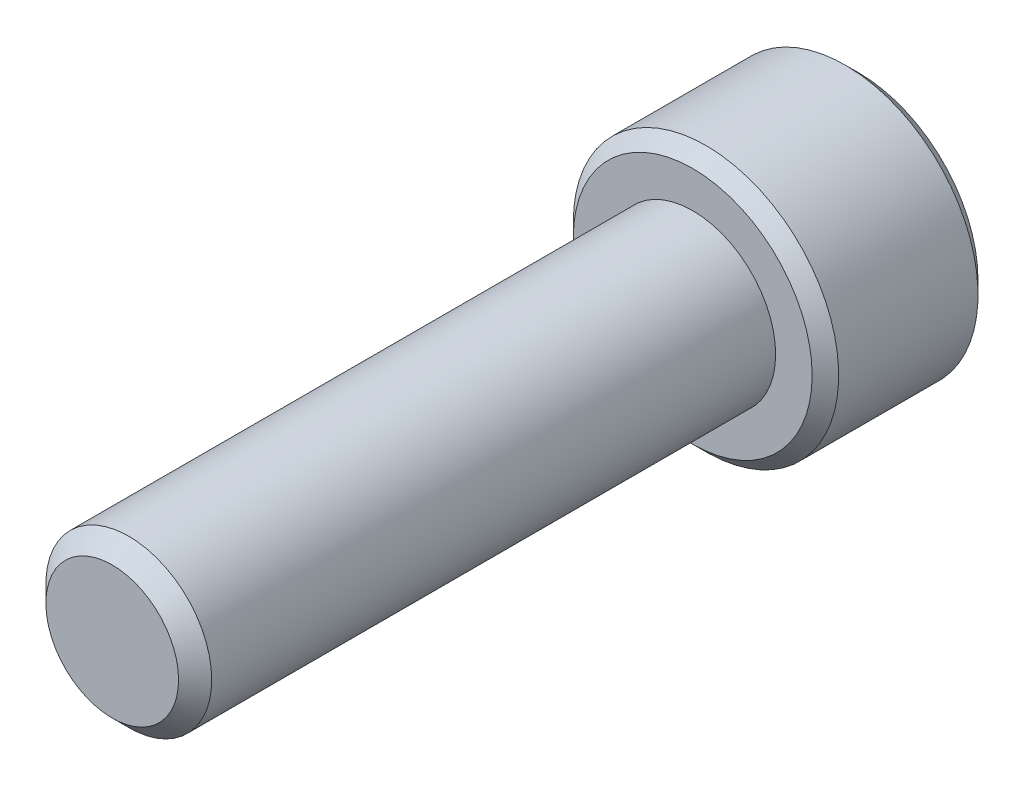
ISO-10303-21;
HEADER;
FILE_DESCRIPTION(('STEP AP214'),'2;1');
FILE_NAME('part.step','',(''),(''),'','','');
FILE_SCHEMA(('AUTOMOTIVE_DESIGN { 1 0 10303 214 1 1 1 1 }'));
ENDSEC;
DATA;
#1=APPLICATION_CONTEXT('core data for automotive mechanical design processes');
#2=APPLICATION_PROTOCOL_DEFINITION('international standard','automotive_design',2000,#1);
#3=PRODUCT_CONTEXT('',#1,'mechanical');
#4=PRODUCT('Part','Part','',(#3));
#5=PRODUCT_RELATED_PRODUCT_CATEGORY('part','',(#4));
#6=PRODUCT_DEFINITION_FORMATION('','',#4);
#7=PRODUCT_DEFINITION_CONTEXT('part definition',#1,'design');
#8=PRODUCT_DEFINITION('design','',#6,#7);
#9=PRODUCT_DEFINITION_SHAPE('','',#8);
#10=(LENGTH_UNIT() NAMED_UNIT(*) SI_UNIT(.MILLI.,.METRE.));
#11=(NAMED_UNIT(*) PLANE_ANGLE_UNIT() SI_UNIT($,.RADIAN.));
#12=(NAMED_UNIT(*) SI_UNIT($,.STERADIAN.) SOLID_ANGLE_UNIT());
#13=UNCERTAINTY_MEASURE_WITH_UNIT(LENGTH_MEASURE(1.E-05),#10,'distance_accuracy_value','');
#14=(GEOMETRIC_REPRESENTATION_CONTEXT(3) GLOBAL_UNCERTAINTY_ASSIGNED_CONTEXT((#13)) GLOBAL_UNIT_ASSIGNED_CONTEXT((#10,
#11,#12)) REPRESENTATION_CONTEXT('',''));
#15=CARTESIAN_POINT('',(0.,0.,0.));
#16=DIRECTION('',(0.,0.,1.));
#17=DIRECTION('',(1.,0.,0.));
#18=AXIS2_PLACEMENT_3D('',#15,#16,#17);
#19=CARTESIAN_POINT('',(0.,0.,-35.));
#20=DIRECTION('',(0.,0.,1.));
#21=DIRECTION('',(1.,0.,0.));
#22=AXIS2_PLACEMENT_3D('',#19,#20,#21);
#23=CYLINDRICAL_SURFACE('',#22,5.);
#24=CARTESIAN_POINT('',(0.,0.,-1.00000000000001));
#25=DIRECTION('',(0.,0.,1.));
#26=DIRECTION('',(1.,0.,0.));
#27=AXIS2_PLACEMENT_3D('',#24,#25,#26);
#28=CIRCLE('',#27,5.);
#29=CARTESIAN_POINT('',(5.,0.,-1.00000000000001));
#30=VERTEX_POINT('',#29);
#31=EDGE_CURVE('E13',#30,#30,#28,.F.);
#32=ORIENTED_EDGE('',*,*,#31,.T.);
#33=EDGE_LOOP('',(#32));
#34=FACE_BOUND('',#33,.T.);
#35=CARTESIAN_POINT('',(0.,0.,-35.));
#36=DIRECTION('',(0.,0.,-1.));
#37=DIRECTION('',(-1.,0.,0.));
#38=AXIS2_PLACEMENT_3D('',#35,#36,#37);
#39=CIRCLE('',#38,5.);
#40=CARTESIAN_POINT('',(-5.,0.,-35.));
#41=VERTEX_POINT('',#40);
#42=EDGE_CURVE('E121',#41,#41,#39,.F.);
#43=ORIENTED_EDGE('',*,*,#42,.T.);
#44=EDGE_LOOP('',(#43));
#45=FACE_BOUND('',#44,.T.);
#46=ADVANCED_FACE('F47',(#34,#45),#23,.T.);
#47=CARTESIAN_POINT('',(0.,0.,0.));
#48=DIRECTION('',(0.,0.,1.));
#49=DIRECTION('',(1.,0.,0.));
#50=AXIS2_PLACEMENT_3D('',#47,#48,#49);
#51=PLANE('',#50);
#52=CARTESIAN_POINT('',(0.,0.,0.));
#53=DIRECTION('',(0.,0.,1.));
#54=DIRECTION('',(1.,0.,0.));
#55=AXIS2_PLACEMENT_3D('',#52,#53,#54);
#56=CIRCLE('',#55,4.);
#57=CARTESIAN_POINT('',(4.,0.,0.));
#58=VERTEX_POINT('',#57);
#59=EDGE_CURVE('E55',#58,#58,#56,.T.);
#60=ORIENTED_EDGE('',*,*,#59,.T.);
#61=EDGE_LOOP('',(#60));
#62=FACE_BOUND('',#61,.T.);
#63=ADVANCED_FACE('F191',(#62),#51,.T.);
#64=CARTESIAN_POINT('',(0.,0.,-45.));
#65=DIRECTION('',(0.,0.,1.));
#66=DIRECTION('',(1.,0.,0.));
#67=AXIS2_PLACEMENT_3D('',#64,#65,#66);
#68=CYLINDRICAL_SURFACE('',#67,8.);
#69=CARTESIAN_POINT('',(0.,0.,-44.2));
#70=DIRECTION('',(0.,0.,-1.));
#71=DIRECTION('',(-1.,0.,0.));
#72=AXIS2_PLACEMENT_3D('',#69,#70,#71);
#73=CIRCLE('',#72,8.);
#74=CARTESIAN_POINT('',(-8.,0.,-44.2));
#75=VERTEX_POINT('',#74);
#76=EDGE_CURVE('E183',#75,#75,#73,.F.);
#77=ORIENTED_EDGE('',*,*,#76,.T.);
#78=EDGE_LOOP('',(#77));
#79=FACE_BOUND('',#78,.T.);
#80=CARTESIAN_POINT('',(0.,0.,-35.8));
#81=DIRECTION('',(0.,0.,-1.));
#82=DIRECTION('',(-1.,0.,0.));
#83=AXIS2_PLACEMENT_3D('',#80,#81,#82);
#84=CIRCLE('',#83,8.);
#85=CARTESIAN_POINT('',(-8.,0.,-35.8));
#86=VERTEX_POINT('',#85);
#87=EDGE_CURVE('E180',#86,#86,#84,.T.);
#88=ORIENTED_EDGE('',*,*,#87,.T.);
#89=EDGE_LOOP('',(#88));
#90=FACE_BOUND('',#89,.T.);
#91=ADVANCED_FACE('F208',(#79,#90),#68,.T.);
#92=CARTESIAN_POINT('',(0.,0.,-45.));
#93=DIRECTION('',(0.,0.,-1.));
#94=DIRECTION('',(-1.,0.,0.));
#95=AXIS2_PLACEMENT_3D('',#92,#93,#94);
#96=PLANE('',#95);
#97=CARTESIAN_POINT('',(0.,0.,-45.));
#98=DIRECTION('',(0.,0.,-1.));
#99=DIRECTION('',(-1.,0.,0.));
#100=AXIS2_PLACEMENT_3D('',#97,#98,#99);
#101=CIRCLE('',#100,7.19999999999999);
#102=CARTESIAN_POINT('',(-7.19999999999999,0.,-45.));
#103=VERTEX_POINT('',#102);
#104=EDGE_CURVE('E120',#103,#103,#101,.T.);
#105=ORIENTED_EDGE('',*,*,#104,.T.);
#106=EDGE_LOOP('',(#105));
#107=FACE_BOUND('',#106,.T.);
#108=CARTESIAN_POINT('',(0.,0.,-45.));
#109=DIRECTION('',(0.,0.,-1.));
#110=DIRECTION('',(-1.,0.,0.));
#111=AXIS2_PLACEMENT_3D('',#108,#109,#110);
#112=CIRCLE('',#111,4.618802153517);
#113=CARTESIAN_POINT('',(-4.,2.3094010767585,-45.));
#114=VERTEX_POINT('',#113);
#115=CARTESIAN_POINT('',(0.,4.61880215351701,-45.));
#116=VERTEX_POINT('',#115);
#117=EDGE_CURVE('E101',#114,#116,#112,.T.);
#118=ORIENTED_EDGE('',*,*,#117,.F.);
#119=CARTESIAN_POINT('',(-4.,-2.3094010767585,-45.));
#120=VERTEX_POINT('',#119);
#121=EDGE_CURVE('E61',#120,#114,#112,.T.);
#122=ORIENTED_EDGE('',*,*,#121,.F.);
#123=CARTESIAN_POINT('',(0.,-4.61880215351701,-45.));
#124=VERTEX_POINT('',#123);
#125=EDGE_CURVE('E415',#124,#120,#112,.T.);
#126=ORIENTED_EDGE('',*,*,#125,.F.);
#127=CARTESIAN_POINT('',(4.,-2.3094010767585,-45.));
#128=VERTEX_POINT('',#127);
#129=EDGE_CURVE('E68',#128,#124,#112,.T.);
#130=ORIENTED_EDGE('',*,*,#129,.F.);
#131=CARTESIAN_POINT('',(4.,2.3094010767585,-45.));
#132=VERTEX_POINT('',#131);
#133=EDGE_CURVE('E142',#132,#128,#112,.T.);
#134=ORIENTED_EDGE('',*,*,#133,.F.);
#135=EDGE_CURVE('E110',#116,#132,#112,.T.);
#136=ORIENTED_EDGE('',*,*,#135,.F.);
#137=EDGE_LOOP('',(#118,#122,#126,#130,#134,#136));
#138=FACE_BOUND('',#137,.T.);
#139=ADVANCED_FACE('F141',(#107,#138),#96,.T.);
#140=CARTESIAN_POINT('',(0.,0.,-35.));
#141=DIRECTION('',(0.,0.,-1.));
#142=DIRECTION('',(-1.,0.,0.));
#143=AXIS2_PLACEMENT_3D('',#140,#141,#142);
#144=PLANE('',#143);
#145=CARTESIAN_POINT('',(0.,0.,-35.));
#146=DIRECTION('',(0.,0.,-1.));
#147=DIRECTION('',(-1.,0.,0.));
#148=AXIS2_PLACEMENT_3D('',#145,#146,#147);
#149=CIRCLE('',#148,7.19999999999999);
#150=CARTESIAN_POINT('',(-7.19999999999999,0.,-35.));
#151=VERTEX_POINT('',#150);
#152=EDGE_CURVE('E186',#151,#151,#149,.F.);
#153=ORIENTED_EDGE('',*,*,#152,.T.);
#154=EDGE_LOOP('',(#153));
#155=FACE_BOUND('',#154,.T.);
#156=ORIENTED_EDGE('',*,*,#42,.F.);
#157=EDGE_LOOP('',(#156));
#158=FACE_BOUND('',#157,.T.);
#159=ADVANCED_FACE('F224',(#155,#158),#144,.F.);
#160=CARTESIAN_POINT('',(0.,0.,-45.));
#161=DIRECTION('',(0.,0.,-1.));
#162=DIRECTION('',(-1.,0.,0.));
#163=AXIS2_PLACEMENT_3D('',#160,#161,#162);
#164=CONICAL_SURFACE('',#163,4.618802153517,0.78539816339745);
#165=ORIENTED_EDGE('',*,*,#135,.T.);
#166=CARTESIAN_POINT('',(-0.000199999999997142,4.61891762357084,-45.0001154743839));
#167=CARTESIAN_POINT('',(0.068580984718387,4.57920690352856,-44.9604088559576));
#168=CARTESIAN_POINT('',(0.137888304896505,4.53919230356691,-44.9219204171132));
#169=CARTESIAN_POINT('',(0.277664036763597,4.45849274714726,-44.8477512237355));
#170=CARTESIAN_POINT('',(0.348133057578707,4.41780743901013,-44.8120720027316));
#171=CARTESIAN_POINT('',(0.562100081603904,4.29427352009148,-44.709500867651));
#172=CARTESIAN_POINT('',(0.707416589267747,4.21037499527406,-44.6475131110126));
#173=CARTESIAN_POINT('',(1.00040214981326,4.04121970302444,-44.5413558690094));
#174=CARTESIAN_POINT('',(1.14799719663765,3.95600566300932,-44.4969190554534));
#175=CARTESIAN_POINT('',(1.44644641508887,3.78369592639708,-44.4284489821295));
#176=CARTESIAN_POINT('',(1.59729144640344,3.69660550696169,-44.4043646378613));
#177=CARTESIAN_POINT('',(1.85726690511356,3.54650860589271,-44.3826348808605));
#178=CARTESIAN_POINT('',(1.96606238220553,3.48369550790705,-44.3794189146409));
#179=CARTESIAN_POINT('',(2.18347675426333,3.35817126167378,-44.384840058225));
#180=CARTESIAN_POINT('',(2.29209557396636,3.29546015687918,-44.3934813231718));
#181=CARTESIAN_POINT('',(2.50830402737816,3.1706321481008,-44.4221240384964));
#182=CARTESIAN_POINT('',(2.61589237292034,3.10851598784036,-44.4421381945513));
#183=CARTESIAN_POINT('',(2.82922129322135,2.98535047827864,-44.4924341573647));
#184=CARTESIAN_POINT('',(2.93496200899965,2.92430104755974,-44.5227151768784));
#185=CARTESIAN_POINT('',(3.12267722089176,2.81592361944283,-44.5850152526942));
#186=CARTESIAN_POINT('',(3.20506731843131,2.76835567444982,-44.6153962798601));
#187=CARTESIAN_POINT('',(3.3683684620413,2.67407371522762,-44.6810544645603));
#188=CARTESIAN_POINT('',(3.44927946303276,2.62735972702479,-44.7163317710398));
#189=CARTESIAN_POINT('',(3.60936749601013,2.53493285809127,-44.7909916870209));
#190=CARTESIAN_POINT('',(3.68854908118624,2.48921734857498,-44.8303613870036));
#191=CARTESIAN_POINT('',(3.84544590098816,2.39863292742735,-44.9126891081433));
#192=CARTESIAN_POINT('',(3.92316199986077,2.35376351682288,-44.955644927802));
#193=CARTESIAN_POINT('',(4.0002,2.30928560670466,-45.0001154743839));
#194=B_SPLINE_CURVE_WITH_KNOTS('',3,(#166,#167,#168,#169,#170,#171,#172,#173,#174,#175,#176,
#177,#178,#179,#180,#181,#182,#183,#184,#185,#186,#187,#188,#189,#190,#191,#192,#193),
.UNSPECIFIED.,.F.,.F.,(4,2,2,2,2,2,2,2,2,2,2,2,2,4),(0.,0.266361961703664,0.53286833440011,
1.06875865685462,1.5961388459405,2.1221913505558,2.49866160599657,2.87526382203494,
3.25228760372076,3.62928248242857,3.92874944437161,4.22822551811344,4.52678401907573,
4.82516056577921),.UNSPECIFIED.);
#195=EDGE_CURVE('E115',#116,#132,#194,.T.);
#196=ORIENTED_EDGE('',*,*,#195,.F.);
#197=EDGE_LOOP('',(#165,#196));
#198=FACE_BOUND('',#197,.T.);
#199=ADVANCED_FACE('F116',(#198),#164,.F.);
#200=ORIENTED_EDGE('',*,*,#133,.T.);
#201=CARTESIAN_POINT('',(4.,-4.60588834585846,-46.4815427100554));
#202=CARTESIAN_POINT('',(4.,-4.49374002821923,-46.3968876312289));
#203=CARTESIAN_POINT('',(4.,-4.3809637982101,-46.3130508557852));
#204=CARTESIAN_POINT('',(4.,-4.1539078224607,-46.1473802935295));
#205=CARTESIAN_POINT('',(4.,-4.03962770639666,-46.0655470148149));
#206=CARTESIAN_POINT('',(4.,-3.80848031083369,-45.9036679969616));
#207=CARTESIAN_POINT('',(4.,-3.69159984616662,-45.8236410211269));
#208=CARTESIAN_POINT('',(4.,-3.45585499794048,-45.6665741495931));
#209=CARTESIAN_POINT('',(4.,-3.33699075539682,-45.5895340428573));
#210=CARTESIAN_POINT('',(4.,-3.09010281107529,-45.4348060364959));
#211=CARTESIAN_POINT('',(4.,-2.96194389824947,-45.3573327874458));
#212=CARTESIAN_POINT('',(4.,-2.7026345868228,-45.207483494942));
#213=CARTESIAN_POINT('',(4.,-2.57148371860611,-45.1351082590594));
#214=CARTESIAN_POINT('',(4.,-2.3062026958856,-44.9970165999514));
#215=CARTESIAN_POINT('',(4.,-2.17208281432629,-44.931280596426));
#216=CARTESIAN_POINT('',(4.,-1.90018524463694,-44.8079389856064));
#217=CARTESIAN_POINT('',(4.,-1.76240924651061,-44.750329696999));
#218=CARTESIAN_POINT('',(4.,-1.49423245423071,-44.6495195910183));
#219=CARTESIAN_POINT('',(4.,-1.36413038006123,-44.6055323527125));
#220=CARTESIAN_POINT('',(4.,-1.10079389466481,-44.5279953825842));
#221=CARTESIAN_POINT('',(4.,-0.96755926832832,-44.49444636981));
#222=CARTESIAN_POINT('',(4.,-0.70096926371332,-44.4400959937613));
#223=CARTESIAN_POINT('',(4.,-0.567659151489365,-44.4190762199428));
#224=CARTESIAN_POINT('',(4.,-0.299613801548666,-44.3901923046075));
#225=CARTESIAN_POINT('',(4.,-0.164878812816917,-44.3823259016629));
#226=CARTESIAN_POINT('',(4.,0.0998110426161455,-44.3803329421123));
#227=CARTESIAN_POINT('',(4.,0.229762408781348,-44.3857193675581));
#228=CARTESIAN_POINT('',(4.,0.488552004486205,-44.4088600629805));
#229=CARTESIAN_POINT('',(4.,0.617390124658867,-44.4266155344344));
#230=CARTESIAN_POINT('',(4.,0.875199003234474,-44.4738276474748));
#231=CARTESIAN_POINT('',(4.,1.00413270849071,-44.5034834133105));
#232=CARTESIAN_POINT('',(4.,1.25919079381533,-44.5729145209428));
#233=CARTESIAN_POINT('',(4.,1.38531540799082,-44.6126890159958));
#234=CARTESIAN_POINT('',(4.,1.64617719318931,-44.7048119901029));
#235=CARTESIAN_POINT('',(4.,1.78061927932313,-44.7579876430135));
#236=CARTESIAN_POINT('',(4.,2.046011294482,-44.8725026332475));
#237=CARTESIAN_POINT('',(4.,2.17695956238624,-44.9338457735747));
#238=CARTESIAN_POINT('',(4.,2.4360038929671,-45.0632362545334));
#239=CARTESIAN_POINT('',(4.,2.5640893557596,-45.1313046457109));
#240=CARTESIAN_POINT('',(4.,2.81731270115426,-45.2726411351195));
#241=CARTESIAN_POINT('',(4.,2.94245104834804,-45.345908406377));
#242=CARTESIAN_POINT('',(4.,3.18400809183147,-45.4928694369693));
#243=CARTESIAN_POINT('',(4.,3.3005507821615,-45.5663604651561));
#244=CARTESIAN_POINT('',(4.,3.53163540616219,-45.7164329441833));
#245=CARTESIAN_POINT('',(4.,3.64617718734196,-45.7930146291055));
#246=CARTESIAN_POINT('',(4.,3.87259303922057,-45.9480834223493));
#247=CARTESIAN_POINT('',(4.,3.98448122200406,-46.0265499994366));
#248=CARTESIAN_POINT('',(4.,4.20672850859698,-46.1855582141516));
#249=CARTESIAN_POINT('',(4.,4.31708802443964,-46.2660992752063));
#250=CARTESIAN_POINT('',(4.,4.42680741385316,-46.3474884762919));
#251=B_SPLINE_CURVE_WITH_KNOTS('',3,(#201,#202,#203,#204,#205,#206,#207,#208,#209,#210,#211,
#212,#213,#214,#215,#216,#217,#218,#219,#220,#221,#222,#223,#224,#225,#226,#227,#228,#229,#230,
#231,#232,#233,#234,#235,#236,#237,#238,#239,#240,#241,#242,#243,#244,#245,#246,#247,#248,#249,
#250),.UNSPECIFIED.,.F.,.F.,(4,2,2,2,2,2,2,2,2,2,2,2,2,2,2,2,2,2,2,2,2,2,2,2,4),(0.,
0.421545463953783,0.843196749317179,1.26811510924698,1.69300339174034,2.14217661823513,
2.59142083852277,3.03929889601296,3.48697341360786,3.8986221993791,4.31029933574146,
4.71457260722766,5.11877636581775,5.50834966824607,5.89796081747125,6.29438282622666,
6.69077167296899,7.12416312979248,7.55775709580142,7.99275404267761,8.42768195006618,
8.8409624853466,9.25427438085209,9.66422889385946,10.0740706699154),.UNSPECIFIED.);
#252=EDGE_CURVE('E109',#132,#128,#251,.F.);
#253=ORIENTED_EDGE('',*,*,#252,.F.);
#254=EDGE_LOOP('',(#200,#253));
#255=FACE_BOUND('',#254,.T.);
#256=ADVANCED_FACE('F291',(#255),#164,.F.);
#257=ORIENTED_EDGE('',*,*,#129,.T.);
#258=CARTESIAN_POINT('',(4.0002,-2.30928560670467,-45.0001154743839));
#259=CARTESIAN_POINT('',(3.93141901528162,-2.34899632674695,-44.9604088559576));
#260=CARTESIAN_POINT('',(3.8621116951035,-2.3890109267086,-44.9219204171132));
#261=CARTESIAN_POINT('',(3.72233596323641,-2.46971048312824,-44.8477512237355));
#262=CARTESIAN_POINT('',(3.6518669424213,-2.51039579126538,-44.8120720027316));
#263=CARTESIAN_POINT('',(3.4378999183961,-2.63392971018403,-44.709500867651));
#264=CARTESIAN_POINT('',(3.29258341073226,-2.71782823500144,-44.6475131110126));
#265=CARTESIAN_POINT('',(2.99959785018675,-2.88698352725107,-44.5413558690094));
#266=CARTESIAN_POINT('',(2.85200280336236,-2.97219756726618,-44.4969190554534));
#267=CARTESIAN_POINT('',(2.55355358491113,-3.14450730387843,-44.4284489821295));
#268=CARTESIAN_POINT('',(2.40270855359656,-3.23159772331381,-44.4043646378613));
#269=CARTESIAN_POINT('',(2.14273309488644,-3.3816946243828,-44.3826348808605));
#270=CARTESIAN_POINT('',(2.03393761779447,-3.44450772236846,-44.3794189146409));
#271=CARTESIAN_POINT('',(1.81652324573667,-3.57003196860173,-44.384840058225));
#272=CARTESIAN_POINT('',(1.70790442603364,-3.63274307339633,-44.3934813231718));
#273=CARTESIAN_POINT('',(1.49169597262184,-3.75757108217471,-44.4221240384964));
#274=CARTESIAN_POINT('',(1.38410762707967,-3.81968724243515,-44.4421381945513));
#275=CARTESIAN_POINT('',(1.17077870677865,-3.94285275199687,-44.4924341573647));
#276=CARTESIAN_POINT('',(1.06503799100036,-4.00390218271577,-44.5227151768784));
#277=CARTESIAN_POINT('',(0.877322779108237,-4.11227961083268,-44.5850152526942));
#278=CARTESIAN_POINT('',(0.794932681568687,-4.15984755582569,-44.6153962798601));
#279=CARTESIAN_POINT('',(0.631631537958704,-4.25412951504789,-44.6810544645603));
#280=CARTESIAN_POINT('',(0.550720536967238,-4.30084350325072,-44.7163317710398));
#281=CARTESIAN_POINT('',(0.390632503989868,-4.39327037218424,-44.7909916870209));
#282=CARTESIAN_POINT('',(0.311450918813762,-4.43898588170052,-44.8303613870036));
#283=CARTESIAN_POINT('',(0.154554099011843,-4.52957030284816,-44.9126891081433));
#284=CARTESIAN_POINT('',(0.0768380001392331,-4.57443971345263,-44.955644927802));
#285=CARTESIAN_POINT('',(-0.000200000000001147,-4.61891762357084,-45.0001154743839));
#286=B_SPLINE_CURVE_WITH_KNOTS('',3,(#258,#259,#260,#261,#262,#263,#264,#265,#266,#267,#268,
#269,#270,#271,#272,#273,#274,#275,#276,#277,#278,#279,#280,#281,#282,#283,#284,#285),
.UNSPECIFIED.,.F.,.F.,(4,2,2,2,2,2,2,2,2,2,2,2,2,4),(0.,0.266361961703661,0.53286833440011,
1.06875865685462,1.59613884594051,2.1221913505558,2.49866160599658,2.87526382203494,
3.25228760372076,3.62928248242858,3.92874944437161,4.22822551811345,4.52678401907573,
4.82516056577922),.UNSPECIFIED.);
#287=EDGE_CURVE('E151',#128,#124,#286,.T.);
#288=ORIENTED_EDGE('',*,*,#287,.F.);
#289=EDGE_LOOP('',(#257,#288));
#290=FACE_BOUND('',#289,.T.);
#291=ADVANCED_FACE('F283',(#290),#164,.F.);
#292=ORIENTED_EDGE('',*,*,#125,.T.);
#293=CARTESIAN_POINT('',(0.000200000000000023,-4.61891762357084,-45.0001154743839));
#294=CARTESIAN_POINT('',(-0.0685809847183827,-4.57920690352856,-44.9604088559576));
#295=CARTESIAN_POINT('',(-0.1378883048965,-4.53919230356691,-44.9219204171132));
#296=CARTESIAN_POINT('',(-0.277664036763593,-4.45849274714727,-44.8477512237355));
#297=CARTESIAN_POINT('',(-0.348133057578705,-4.41780743901013,-44.8120720027316));
#298=CARTESIAN_POINT('',(-0.562100081603903,-4.29427352009148,-44.709500867651));
#299=CARTESIAN_POINT('',(-0.707416589267745,-4.21037499527407,-44.6475131110126));
#300=CARTESIAN_POINT('',(-1.00040214981325,-4.04121970302444,-44.5413558690094));
#301=CARTESIAN_POINT('',(-1.14799719663764,-3.95600566300933,-44.4969190554534));
#302=CARTESIAN_POINT('',(-1.44644641508887,-3.78369592639708,-44.4284489821295));
#303=CARTESIAN_POINT('',(-1.59729144640344,-3.6966055069617,-44.4043646378613));
#304=CARTESIAN_POINT('',(-1.85726690511356,-3.54650860589271,-44.3826348808605));
#305=CARTESIAN_POINT('',(-1.96606238220553,-3.48369550790705,-44.3794189146409));
#306=CARTESIAN_POINT('',(-2.18347675426333,-3.35817126167378,-44.384840058225));
#307=CARTESIAN_POINT('',(-2.29209557396636,-3.29546015687918,-44.3934813231718));
#308=CARTESIAN_POINT('',(-2.50830402737816,-3.17063214810081,-44.4221240384964));
#309=CARTESIAN_POINT('',(-2.61589237292033,-3.10851598784036,-44.4421381945513));
#310=CARTESIAN_POINT('',(-2.82922129322134,-2.98535047827864,-44.4924341573647));
#311=CARTESIAN_POINT('',(-2.93496200899964,-2.92430104755974,-44.5227151768784));
#312=CARTESIAN_POINT('',(-3.12267722089176,-2.81592361944283,-44.5850152526942));
#313=CARTESIAN_POINT('',(-3.20506731843131,-2.76835567444982,-44.6153962798601));
#314=CARTESIAN_POINT('',(-3.3683684620413,-2.67407371522762,-44.6810544645603));
#315=CARTESIAN_POINT('',(-3.44927946303277,-2.62735972702479,-44.7163317710398));
#316=CARTESIAN_POINT('',(-3.60936749601014,-2.53493285809127,-44.7909916870209));
#317=CARTESIAN_POINT('',(-3.68854908118624,-2.48921734857498,-44.8303613870036));
#318=CARTESIAN_POINT('',(-3.84544590098816,-2.39863292742735,-44.9126891081433));
#319=CARTESIAN_POINT('',(-3.92316199986077,-2.35376351682288,-44.955644927802));
#320=CARTESIAN_POINT('',(-4.0002,-2.30928560670467,-45.0001154743839));
#321=B_SPLINE_CURVE_WITH_KNOTS('',3,(#293,#294,#295,#296,#297,#298,#299,#300,#301,#302,#303,
#304,#305,#306,#307,#308,#309,#310,#311,#312,#313,#314,#315,#316,#317,#318,#319,#320),
.UNSPECIFIED.,.F.,.F.,(4,2,2,2,2,2,2,2,2,2,2,2,2,4),(0.,0.266361961703662,0.532868334400111,
1.06875865685462,1.5961388459405,2.1221913505558,2.49866160599658,2.87526382203494,
3.25228760372076,3.62928248242857,3.92874944437161,4.22822551811345,4.52678401907574,
4.82516056577922),.UNSPECIFIED.);
#322=EDGE_CURVE('E378',#124,#120,#321,.T.);
#323=ORIENTED_EDGE('',*,*,#322,.F.);
#324=EDGE_LOOP('',(#292,#323));
#325=FACE_BOUND('',#324,.T.);
#326=ADVANCED_FACE('F276',(#325),#164,.F.);
#327=ORIENTED_EDGE('',*,*,#121,.T.);
#328=CARTESIAN_POINT('',(-4.,-4.6058883465286,-46.4815427105614));
#329=CARTESIAN_POINT('',(-4.,-4.49374002887056,-46.3968876317154));
#330=CARTESIAN_POINT('',(-4.,-4.38096379884257,-46.3130508562522));
#331=CARTESIAN_POINT('',(-4.,-4.15390782305526,-46.1473802939577));
#332=CARTESIAN_POINT('',(-4.,-4.03962770697217,-46.0655470152237));
#333=CARTESIAN_POINT('',(-4.,-3.80848031137045,-45.9036679973316));
#334=CARTESIAN_POINT('',(-4.,-3.69159984668369,-45.8236410214775));
#335=CARTESIAN_POINT('',(-4.,-3.45585499841779,-45.666574149905));
#336=CARTESIAN_POINT('',(-4.,-3.33699075585407,-45.5895340431501));
#337=CARTESIAN_POINT('',(-4.,-3.09010281148929,-45.4348060367488));
#338=CARTESIAN_POINT('',(-4.,-2.96194389864023,-45.357332787678));
#339=CARTESIAN_POINT('',(-4.,-2.70263458716623,-45.207483495134));
#340=CARTESIAN_POINT('',(-4.,-2.57148371892545,-45.1351082592317));
#341=CARTESIAN_POINT('',(-4.,-2.3062026961559,-44.9970166000861));
#342=CARTESIAN_POINT('',(-4.,-2.17208281457164,-44.9312805965426));
#343=CARTESIAN_POINT('',(-4.,-1.90018524483105,-44.8079389856892));
#344=CARTESIAN_POINT('',(-4.,-1.76240924667844,-44.750329697066));
#345=CARTESIAN_POINT('',(-4.,-1.49423245438718,-44.6495195910735));
#346=CARTESIAN_POINT('',(-4.,-1.36413038023379,-44.6055323527688));
#347=CARTESIAN_POINT('',(-4.,-1.10079389487004,-44.5279953826392));
#348=CARTESIAN_POINT('',(-4.,-0.967559268550155,-44.4944463698627));
#349=CARTESIAN_POINT('',(-4.,-0.700969263967812,-44.4400959938058));
#350=CARTESIAN_POINT('',(-4.,-0.567659151759904,-44.4190762199813));
#351=CARTESIAN_POINT('',(-4.,-0.299613801850762,-44.3901923046306));
#352=CARTESIAN_POINT('',(-4.,-0.164878813134523,-44.3823259016765));
#353=CARTESIAN_POINT('',(-4.,0.099811042269923,-44.3803329421041));
#354=CARTESIAN_POINT('',(-4.,0.229762408421979,-44.3857193675379));
#355=CARTESIAN_POINT('',(-4.,0.488552004101857,-44.4088600629343));
#356=CARTESIAN_POINT('',(-4.,0.617390124262688,-44.4266155343742));
#357=CARTESIAN_POINT('',(-4.,0.875199002814938,-44.4738276473854));
#358=CARTESIAN_POINT('',(-4.,1.00413270805968,-44.5034834132057));
#359=CARTESIAN_POINT('',(-4.,1.25919079336244,-44.5729145208069));
#360=CARTESIAN_POINT('',(-4.,1.38531540752754,-44.6126890158442));
#361=CARTESIAN_POINT('',(-4.,1.64617719267059,-44.7048119899065));
#362=CARTESIAN_POINT('',(-4.,1.78061927876033,-44.7579876427854));
#363=CARTESIAN_POINT('',(-4.,2.04601129383331,-44.8725026329529));
#364=CARTESIAN_POINT('',(-4.,2.17695956169573,-44.9338457732451));
#365=CARTESIAN_POINT('',(-4.,2.43600389219443,-45.063236254132));
#366=CARTESIAN_POINT('',(-4.,2.56408935494662,-45.1313046452726));
#367=CARTESIAN_POINT('',(-4.,2.81731270026197,-45.2726411346061));
#368=CARTESIAN_POINT('',(-4.,2.94245104741675,-45.3459084058254));
#369=CARTESIAN_POINT('',(-4.,3.18400809082929,-45.4928694363453));
#370=CARTESIAN_POINT('',(-4.,3.30055078112732,-45.566360464498));
#371=CARTESIAN_POINT('',(-4.,3.53163540506443,-45.7164329434568));
#372=CARTESIAN_POINT('',(-4.,3.64617718621265,-45.7930146283448));
#373=CARTESIAN_POINT('',(-4.,3.87259303802889,-45.9480834215204));
#374=CARTESIAN_POINT('',(-4.,3.98448122078158,-46.0265499985739));
#375=CARTESIAN_POINT('',(-4.,4.20672850731309,-46.1855582132212));
#376=CARTESIAN_POINT('',(-4.,4.31708802312515,-46.2660992742421));
#377=CARTESIAN_POINT('',(-4.,4.42680741250812,-46.3474884752939));
#378=B_SPLINE_CURVE_WITH_KNOTS('',3,(#328,#329,#330,#331,#332,#333,#334,#335,#336,#337,#338,
#339,#340,#341,#342,#343,#344,#345,#346,#347,#348,#349,#350,#351,#352,#353,#354,#355,#356,#357,
#358,#359,#360,#361,#362,#363,#364,#365,#366,#367,#368,#369,#370,#371,#372,#373,#374,#375,#376,
#377),.UNSPECIFIED.,.F.,.F.,(4,2,2,2,2,2,2,2,2,2,2,2,2,2,2,2,2,2,2,2,2,2,2,2,4),(0.,
0.421545464034018,0.843196749477674,1.26811510948924,1.69300339206436,2.14217661865082,
2.5914208390302,3.03929889661136,3.48697341429708,3.89862220002183,4.31029933633779,
4.71457260777947,5.11877636632505,5.50834966871263,5.89796081789702,6.29438282660854,
6.69077167330698,7.12416312997274,7.55775709582377,7.99275404254114,8.42768194977097,
8.84096248491557,9.25427438028522,9.6642288931586,10.0740706690805),.UNSPECIFIED.);
#379=EDGE_CURVE('E131',#120,#114,#378,.T.);
#380=ORIENTED_EDGE('',*,*,#379,.F.);
#381=EDGE_LOOP('',(#327,#380));
#382=FACE_BOUND('',#381,.T.);
#383=ADVANCED_FACE('F268',(#382),#164,.F.);
#384=ORIENTED_EDGE('',*,*,#117,.T.);
#385=CARTESIAN_POINT('',(-4.0002,2.30928560670467,-45.0001154743839));
#386=CARTESIAN_POINT('',(-3.93141901528161,2.34899632674695,-44.9604088559576));
#387=CARTESIAN_POINT('',(-3.86211169510349,2.3890109267086,-44.9219204171132));
#388=CARTESIAN_POINT('',(-3.7223359632364,2.46971048312824,-44.8477512237355));
#389=CARTESIAN_POINT('',(-3.65186694242129,2.51039579126538,-44.8120720027316));
#390=CARTESIAN_POINT('',(-3.4378999183961,2.63392971018403,-44.709500867651));
#391=CARTESIAN_POINT('',(-3.29258341073225,2.71782823500144,-44.6475131110126));
#392=CARTESIAN_POINT('',(-2.99959785018674,2.88698352725107,-44.5413558690094));
#393=CARTESIAN_POINT('',(-2.85200280336235,2.97219756726618,-44.4969190554534));
#394=CARTESIAN_POINT('',(-2.55355358491113,3.14450730387843,-44.4284489821295));
#395=CARTESIAN_POINT('',(-2.40270855359656,3.23159772331382,-44.4043646378613));
#396=CARTESIAN_POINT('',(-2.14273309488643,3.3816946243828,-44.3826348808605));
#397=CARTESIAN_POINT('',(-2.03393761779446,3.44450772236846,-44.3794189146409));
#398=CARTESIAN_POINT('',(-1.81652324573666,3.57003196860173,-44.384840058225));
#399=CARTESIAN_POINT('',(-1.70790442603364,3.63274307339633,-44.3934813231718));
#400=CARTESIAN_POINT('',(-1.49169597262183,3.75757108217471,-44.4221240384964));
#401=CARTESIAN_POINT('',(-1.38410762707966,3.81968724243515,-44.4421381945513));
#402=CARTESIAN_POINT('',(-1.17077870677865,3.94285275199687,-44.4924341573647));
#403=CARTESIAN_POINT('',(-1.06503799100035,4.00390218271578,-44.5227151768784));
#404=CARTESIAN_POINT('',(-0.87732277910823,4.11227961083268,-44.5850152526942));
#405=CARTESIAN_POINT('',(-0.794932681568682,4.15984755582569,-44.6153962798601));
#406=CARTESIAN_POINT('',(-0.6316315379587,4.25412951504789,-44.6810544645603));
#407=CARTESIAN_POINT('',(-0.550720536967234,4.30084350325072,-44.7163317710398));
#408=CARTESIAN_POINT('',(-0.390632503989865,4.39327037218424,-44.7909916870209));
#409=CARTESIAN_POINT('',(-0.31145091881376,4.43898588170052,-44.8303613870036));
#410=CARTESIAN_POINT('',(-0.154554099011844,4.52957030284816,-44.9126891081433));
#411=CARTESIAN_POINT('',(-0.0768380001392345,4.57443971345262,-44.9556449278019));
#412=CARTESIAN_POINT('',(0.000199999999999371,4.61891762357084,-45.0001154743839));
#413=B_SPLINE_CURVE_WITH_KNOTS('',3,(#385,#386,#387,#388,#389,#390,#391,#392,#393,#394,#395,
#396,#397,#398,#399,#400,#401,#402,#403,#404,#405,#406,#407,#408,#409,#410,#411,#412),
.UNSPECIFIED.,.F.,.F.,(4,2,2,2,2,2,2,2,2,2,2,2,2,4),(0.,0.266361961703665,0.532868334400109,
1.06875865685462,1.59613884594051,2.1221913505558,2.49866160599658,2.87526382203494,
3.25228760372077,3.62928248242858,3.92874944437161,4.22822551811344,4.52678401907573,
4.82516056577921),.UNSPECIFIED.);
#414=EDGE_CURVE('E105',#114,#116,#413,.T.);
#415=ORIENTED_EDGE('',*,*,#414,.F.);
#416=EDGE_LOOP('',(#384,#415));
#417=FACE_BOUND('',#416,.T.);
#418=ADVANCED_FACE('F103',(#417),#164,.F.);
#419=CARTESIAN_POINT('',(4.,6.9282032302755,-39.));
#420=DIRECTION('',(0.,0.,-1.));
#421=DIRECTION('',(-1.,0.,0.));
#422=AXIS2_PLACEMENT_3D('',#419,#420,#421);
#423=PLANE('',#422);
#424=DIRECTION('',(0.866025403784439,0.5,0.));
#425=VECTOR('',#424,1.);
#426=CARTESIAN_POINT('',(-4.,2.3094010767585,-39.));
#427=LINE('',#426,#425);
#428=CARTESIAN_POINT('',(-4.,2.3094010767585,-39.));
#429=VERTEX_POINT('',#428);
#430=CARTESIAN_POINT('',(0.,4.618802153517,-39.));
#431=VERTEX_POINT('',#430);
#432=EDGE_CURVE('E130',#429,#431,#427,.T.);
#433=ORIENTED_EDGE('',*,*,#432,.T.);
#434=DIRECTION('',(0.866025403784439,-0.5,0.));
#435=VECTOR('',#434,1.);
#436=CARTESIAN_POINT('',(0.,4.618802153517,-39.));
#437=LINE('',#436,#435);
#438=CARTESIAN_POINT('',(4.,2.3094010767585,-39.));
#439=VERTEX_POINT('',#438);
#440=EDGE_CURVE('E135',#431,#439,#437,.T.);
#441=ORIENTED_EDGE('',*,*,#440,.T.);
#442=DIRECTION('',(0.,-1.,0.));
#443=VECTOR('',#442,1.);
#444=CARTESIAN_POINT('',(4.,2.3094010767585,-39.));
#445=LINE('',#444,#443);
#446=CARTESIAN_POINT('',(4.,-2.3094010767585,-39.));
#447=VERTEX_POINT('',#446);
#448=EDGE_CURVE('E388',#439,#447,#445,.T.);
#449=ORIENTED_EDGE('',*,*,#448,.T.);
#450=DIRECTION('',(-0.866025403784439,-0.5,0.));
#451=VECTOR('',#450,1.);
#452=CARTESIAN_POINT('',(4.,-2.3094010767585,-39.));
#453=LINE('',#452,#451);
#454=CARTESIAN_POINT('',(0.,-4.61880215351701,-39.));
#455=VERTEX_POINT('',#454);
#456=EDGE_CURVE('E391',#447,#455,#453,.T.);
#457=ORIENTED_EDGE('',*,*,#456,.T.);
#458=DIRECTION('',(-0.866025403784439,0.5,0.));
#459=VECTOR('',#458,1.);
#460=CARTESIAN_POINT('',(0.,-4.61880215351701,-39.));
#461=LINE('',#460,#459);
#462=CARTESIAN_POINT('',(-4.,-2.3094010767585,-39.));
#463=VERTEX_POINT('',#462);
#464=EDGE_CURVE('E394',#455,#463,#461,.T.);
#465=ORIENTED_EDGE('',*,*,#464,.T.);
#466=DIRECTION('',(0.,1.,0.));
#467=VECTOR('',#466,1.);
#468=CARTESIAN_POINT('',(-4.,-2.3094010767585,-39.));
#469=LINE('',#468,#467);
#470=EDGE_CURVE('E138',#463,#429,#469,.T.);
#471=ORIENTED_EDGE('',*,*,#470,.T.);
#472=EDGE_LOOP('',(#433,#441,#449,#457,#465,#471));
#473=FACE_BOUND('',#472,.T.);
#474=ADVANCED_FACE('F170',(#473),#423,.T.);
#475=CARTESIAN_POINT('',(0.,4.618802153517,-39.));
#476=DIRECTION('',(0.5,0.866025403784439,0.));
#477=DIRECTION('',(-0.866025403784439,0.5,0.));
#478=AXIS2_PLACEMENT_3D('',#475,#476,#477);
#479=PLANE('',#478);
#480=DIRECTION('',(0.,0.,-1.));
#481=VECTOR('',#480,1.);
#482=CARTESIAN_POINT('',(0.,4.618802153517,-39.));
#483=LINE('',#482,#481);
#484=EDGE_CURVE('E127',#431,#116,#483,.T.);
#485=ORIENTED_EDGE('',*,*,#484,.T.);
#486=ORIENTED_EDGE('',*,*,#195,.T.);
#487=DIRECTION('',(0.,0.,-1.));
#488=VECTOR('',#487,1.);
#489=CARTESIAN_POINT('',(4.,2.3094010767585,-39.));
#490=LINE('',#489,#488);
#491=EDGE_CURVE('E137',#439,#132,#490,.T.);
#492=ORIENTED_EDGE('',*,*,#491,.F.);
#493=ORIENTED_EDGE('',*,*,#440,.F.);
#494=EDGE_LOOP('',(#485,#486,#492,#493));
#495=FACE_BOUND('',#494,.T.);
#496=ADVANCED_FACE('F133',(#495),#479,.F.);
#497=CARTESIAN_POINT('',(4.,2.3094010767585,-39.));
#498=DIRECTION('',(1.,0.,0.));
#499=DIRECTION('',(0.,0.,-1.));
#500=AXIS2_PLACEMENT_3D('',#497,#498,#499);
#501=PLANE('',#500);
#502=ORIENTED_EDGE('',*,*,#491,.T.);
#503=ORIENTED_EDGE('',*,*,#252,.T.);
#504=DIRECTION('',(0.,0.,-1.));
#505=VECTOR('',#504,1.);
#506=CARTESIAN_POINT('',(4.,-2.3094010767585,-39.));
#507=LINE('',#506,#505);
#508=EDGE_CURVE('E405',#447,#128,#507,.T.);
#509=ORIENTED_EDGE('',*,*,#508,.F.);
#510=ORIENTED_EDGE('',*,*,#448,.F.);
#511=EDGE_LOOP('',(#502,#503,#509,#510));
#512=FACE_BOUND('',#511,.T.);
#513=ADVANCED_FACE('F159',(#512),#501,.F.);
#514=CARTESIAN_POINT('',(4.,-2.3094010767585,-39.));
#515=DIRECTION('',(0.5,-0.866025403784439,0.));
#516=DIRECTION('',(0.866025403784439,0.5,0.));
#517=AXIS2_PLACEMENT_3D('',#514,#515,#516);
#518=PLANE('',#517);
#519=ORIENTED_EDGE('',*,*,#508,.T.);
#520=ORIENTED_EDGE('',*,*,#287,.T.);
#521=DIRECTION('',(0.,0.,-1.));
#522=VECTOR('',#521,1.);
#523=CARTESIAN_POINT('',(0.,-4.61880215351701,-39.));
#524=LINE('',#523,#522);
#525=EDGE_CURVE('E402',#455,#124,#524,.T.);
#526=ORIENTED_EDGE('',*,*,#525,.F.);
#527=ORIENTED_EDGE('',*,*,#456,.F.);
#528=EDGE_LOOP('',(#519,#520,#526,#527));
#529=FACE_BOUND('',#528,.T.);
#530=ADVANCED_FACE('F163',(#529),#518,.F.);
#531=CARTESIAN_POINT('',(0.,-4.61880215351701,-39.));
#532=DIRECTION('',(-0.5,-0.866025403784439,0.));
#533=DIRECTION('',(0.866025403784439,-0.5,0.));
#534=AXIS2_PLACEMENT_3D('',#531,#532,#533);
#535=PLANE('',#534);
#536=ORIENTED_EDGE('',*,*,#525,.T.);
#537=ORIENTED_EDGE('',*,*,#322,.T.);
#538=DIRECTION('',(0.,0.,-1.));
#539=VECTOR('',#538,1.);
#540=CARTESIAN_POINT('',(-4.,-2.3094010767585,-39.));
#541=LINE('',#540,#539);
#542=EDGE_CURVE('E400',#463,#120,#541,.T.);
#543=ORIENTED_EDGE('',*,*,#542,.F.);
#544=ORIENTED_EDGE('',*,*,#464,.F.);
#545=EDGE_LOOP('',(#536,#537,#543,#544));
#546=FACE_BOUND('',#545,.T.);
#547=ADVANCED_FACE('F327',(#546),#535,.F.);
#548=CARTESIAN_POINT('',(-4.,-2.3094010767585,-39.));
#549=DIRECTION('',(-1.,0.,0.));
#550=DIRECTION('',(0.,-1.,0.));
#551=AXIS2_PLACEMENT_3D('',#548,#549,#550);
#552=PLANE('',#551);
#553=ORIENTED_EDGE('',*,*,#542,.T.);
#554=ORIENTED_EDGE('',*,*,#379,.T.);
#555=DIRECTION('',(0.,0.,-1.));
#556=VECTOR('',#555,1.);
#557=CARTESIAN_POINT('',(-4.,2.3094010767585,-39.));
#558=LINE('',#557,#556);
#559=EDGE_CURVE('E129',#429,#114,#558,.T.);
#560=ORIENTED_EDGE('',*,*,#559,.F.);
#561=ORIENTED_EDGE('',*,*,#470,.F.);
#562=EDGE_LOOP('',(#553,#554,#560,#561));
#563=FACE_BOUND('',#562,.T.);
#564=ADVANCED_FACE('F218',(#563),#552,.F.);
#565=CARTESIAN_POINT('',(-4.,2.3094010767585,-39.));
#566=DIRECTION('',(-0.5,0.866025403784439,0.));
#567=DIRECTION('',(-0.866025403784439,-0.5,0.));
#568=AXIS2_PLACEMENT_3D('',#565,#566,#567);
#569=PLANE('',#568);
#570=ORIENTED_EDGE('',*,*,#559,.T.);
#571=ORIENTED_EDGE('',*,*,#414,.T.);
#572=ORIENTED_EDGE('',*,*,#484,.F.);
#573=ORIENTED_EDGE('',*,*,#432,.F.);
#574=EDGE_LOOP('',(#570,#571,#572,#573));
#575=FACE_BOUND('',#574,.T.);
#576=ADVANCED_FACE('F125',(#575),#569,.F.);
#577=CARTESIAN_POINT('',(0.,0.,-45.));
#578=DIRECTION('',(0.,0.,1.));
#579=DIRECTION('',(1.,0.,0.));
#580=AXIS2_PLACEMENT_3D('',#577,#578,#579);
#581=CONICAL_SURFACE('',#580,7.19999999999999,0.785398163397448);
#582=ORIENTED_EDGE('',*,*,#76,.F.);
#583=EDGE_LOOP('',(#582));
#584=FACE_BOUND('',#583,.T.);
#585=ORIENTED_EDGE('',*,*,#104,.F.);
#586=EDGE_LOOP('',(#585));
#587=FACE_BOUND('',#586,.T.);
#588=ADVANCED_FACE('F199',(#584,#587),#581,.T.);
#589=CARTESIAN_POINT('',(0.,0.,-35.8));
#590=DIRECTION('',(0.,0.,-1.));
#591=DIRECTION('',(-1.,0.,0.));
#592=AXIS2_PLACEMENT_3D('',#589,#590,#591);
#593=CONICAL_SURFACE('',#592,8.,0.785398163397448);
#594=ORIENTED_EDGE('',*,*,#152,.F.);
#595=EDGE_LOOP('',(#594));
#596=FACE_BOUND('',#595,.T.);
#597=ORIENTED_EDGE('',*,*,#87,.F.);
#598=EDGE_LOOP('',(#597));
#599=FACE_BOUND('',#598,.T.);
#600=ADVANCED_FACE('F194',(#596,#599),#593,.T.);
#601=CARTESIAN_POINT('',(0.,0.,0.));
#602=DIRECTION('',(0.,0.,-1.));
#603=DIRECTION('',(-1.,0.,0.));
#604=AXIS2_PLACEMENT_3D('',#601,#602,#603);
#605=CONICAL_SURFACE('',#604,4.,0.785398163397446);
#606=ORIENTED_EDGE('',*,*,#31,.F.);
#607=EDGE_LOOP('',(#606));
#608=FACE_BOUND('',#607,.T.);
#609=ORIENTED_EDGE('',*,*,#59,.F.);
#610=EDGE_LOOP('',(#609));
#611=FACE_BOUND('',#610,.T.);
#612=ADVANCED_FACE('F49',(#608,#611),#605,.T.);
#613=CLOSED_SHELL('',(#46,#63,#91,#139,#159,#199,#256,#291,#326,#383,#418,#474,#496,#513,#530,
#547,#564,#576,#588,#600,#612));
#614=MANIFOLD_SOLID_BREP('B2',#613);
#615=ADVANCED_BREP_SHAPE_REPRESENTATION('',(#18,#614),#14);
#616=SHAPE_DEFINITION_REPRESENTATION(#9,#615);
ENDSEC;
END-ISO-10303-21;
